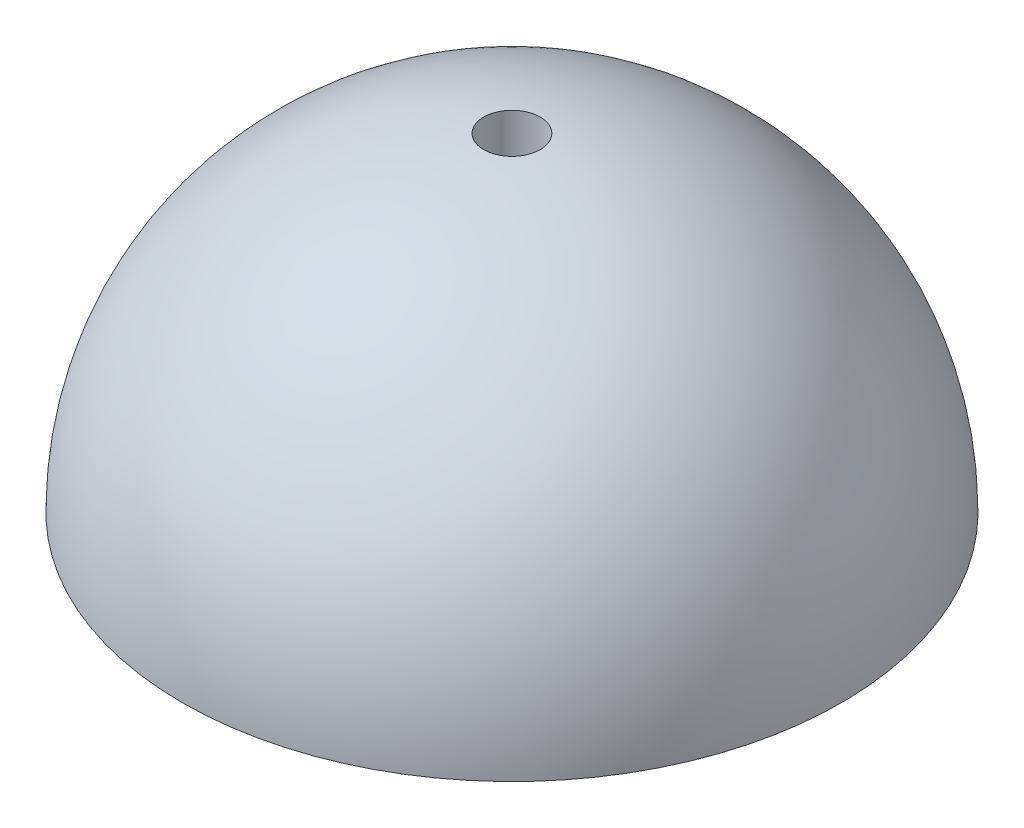
ISO-10303-21;
HEADER;
FILE_DESCRIPTION(('STEP AP214'),'2;1');
FILE_NAME('part.step','',(''),(''),'','','');
FILE_SCHEMA(('AUTOMOTIVE_DESIGN { 1 0 10303 214 1 1 1 1 }'));
ENDSEC;
DATA;
#1=APPLICATION_CONTEXT('core data for automotive mechanical design processes');
#2=APPLICATION_PROTOCOL_DEFINITION('international standard','automotive_design',2000,#1);
#3=PRODUCT_CONTEXT('',#1,'mechanical');
#4=PRODUCT('Part','Part','',(#3));
#5=PRODUCT_RELATED_PRODUCT_CATEGORY('part','',(#4));
#6=PRODUCT_DEFINITION_FORMATION('','',#4);
#7=PRODUCT_DEFINITION_CONTEXT('part definition',#1,'design');
#8=PRODUCT_DEFINITION('design','',#6,#7);
#9=PRODUCT_DEFINITION_SHAPE('','',#8);
#10=(LENGTH_UNIT() NAMED_UNIT(*) SI_UNIT(.MILLI.,.METRE.));
#11=(NAMED_UNIT(*) PLANE_ANGLE_UNIT() SI_UNIT($,.RADIAN.));
#12=(NAMED_UNIT(*) SI_UNIT($,.STERADIAN.) SOLID_ANGLE_UNIT());
#13=UNCERTAINTY_MEASURE_WITH_UNIT(LENGTH_MEASURE(1.E-05),#10,'distance_accuracy_value','');
#14=(GEOMETRIC_REPRESENTATION_CONTEXT(3) GLOBAL_UNCERTAINTY_ASSIGNED_CONTEXT((#13)) GLOBAL_UNIT_ASSIGNED_CONTEXT((#10,
#11,#12)) REPRESENTATION_CONTEXT('',''));
#15=CARTESIAN_POINT('',(0.,0.,0.));
#16=DIRECTION('',(0.,0.,1.));
#17=DIRECTION('',(1.,0.,0.));
#18=AXIS2_PLACEMENT_3D('',#15,#16,#17);
#19=CARTESIAN_POINT('',(0.,17.5,0.));
#20=DIRECTION('',(0.,1.,0.));
#21=DIRECTION('',(0.,0.,1.00000000000007));
#22=AXIS2_PLACEMENT_3D('',#19,#20,#21);
#23=CYLINDRICAL_SURFACE('',#22,1.5);
#24=CARTESIAN_POINT('',(0.,0.,0.));
#25=DIRECTION('',(0.,1.,0.));
#26=DIRECTION('',(0.,0.,1.00000000000007));
#27=AXIS2_PLACEMENT_3D('',#24,#25,#26);
#28=CIRCLE('',#27,1.5);
#29=CARTESIAN_POINT('',(0.,0.,1.50000000000011));
#30=VERTEX_POINT('',#29);
#31=EDGE_CURVE('E50',#30,#30,#28,.T.);
#32=ORIENTED_EDGE('',*,*,#31,.F.);
#33=EDGE_LOOP('',(#32));
#34=FACE_BOUND('',#33,.T.);
#35=CARTESIAN_POINT('',(0.,17.4355957741627,0.));
#36=DIRECTION('',(0.,1.,0.));
#37=DIRECTION('',(0.,0.,1.00000000000007));
#38=AXIS2_PLACEMENT_3D('',#35,#36,#37);
#39=CIRCLE('',#38,1.5);
#40=CARTESIAN_POINT('',(0.,17.4355957741627,1.50000000000011));
#41=VERTEX_POINT('',#40);
#42=EDGE_CURVE('E10',#41,#41,#39,.T.);
#43=ORIENTED_EDGE('',*,*,#42,.T.);
#44=EDGE_LOOP('',(#43));
#45=FACE_BOUND('',#44,.T.);
#46=ADVANCED_FACE('F37',(#34,#45),#23,.F.);
#47=CARTESIAN_POINT('',(0.,0.,0.));
#48=DIRECTION('',(0.,1.,0.));
#49=DIRECTION('',(-1.00000000000007,0.,0.));
#50=AXIS2_PLACEMENT_3D('',#47,#48,#49);
#51=SPHERICAL_SURFACE('',#50,17.5);
#52=CARTESIAN_POINT('',(0.,0.,0.));
#53=DIRECTION('',(0.,1.,0.));
#54=DIRECTION('',(0.,0.,1.00000000000007));
#55=AXIS2_PLACEMENT_3D('',#52,#53,#54);
#56=CIRCLE('',#55,17.5);
#57=CARTESIAN_POINT('',(0.,0.,17.5000000000012));
#58=VERTEX_POINT('',#57);
#59=EDGE_CURVE('E44',#58,#58,#56,.T.);
#60=ORIENTED_EDGE('',*,*,#59,.T.);
#61=EDGE_LOOP('',(#60));
#62=FACE_BOUND('',#61,.T.);
#63=ORIENTED_EDGE('',*,*,#42,.F.);
#64=EDGE_LOOP('',(#63));
#65=FACE_BOUND('',#64,.T.);
#66=ADVANCED_FACE('F63',(#62,#65),#51,.T.);
#67=CARTESIAN_POINT('',(0.,0.,0.));
#68=DIRECTION('',(0.,1.,0.));
#69=DIRECTION('',(0.,0.,1.00000000000007));
#70=AXIS2_PLACEMENT_3D('',#67,#68,#69);
#71=PLANE('',#70);
#72=ORIENTED_EDGE('',*,*,#59,.F.);
#73=EDGE_LOOP('',(#72));
#74=FACE_BOUND('',#73,.T.);
#75=ORIENTED_EDGE('',*,*,#31,.T.);
#76=EDGE_LOOP('',(#75));
#77=FACE_BOUND('',#76,.T.);
#78=ADVANCED_FACE('F60',(#74,#77),#71,.F.);
#79=CLOSED_SHELL('',(#46,#66,#78));
#80=MANIFOLD_SOLID_BREP('B2',#79);
#81=ADVANCED_BREP_SHAPE_REPRESENTATION('',(#18,#80),#14);
#82=SHAPE_DEFINITION_REPRESENTATION(#9,#81);
ENDSEC;
END-ISO-10303-21;
